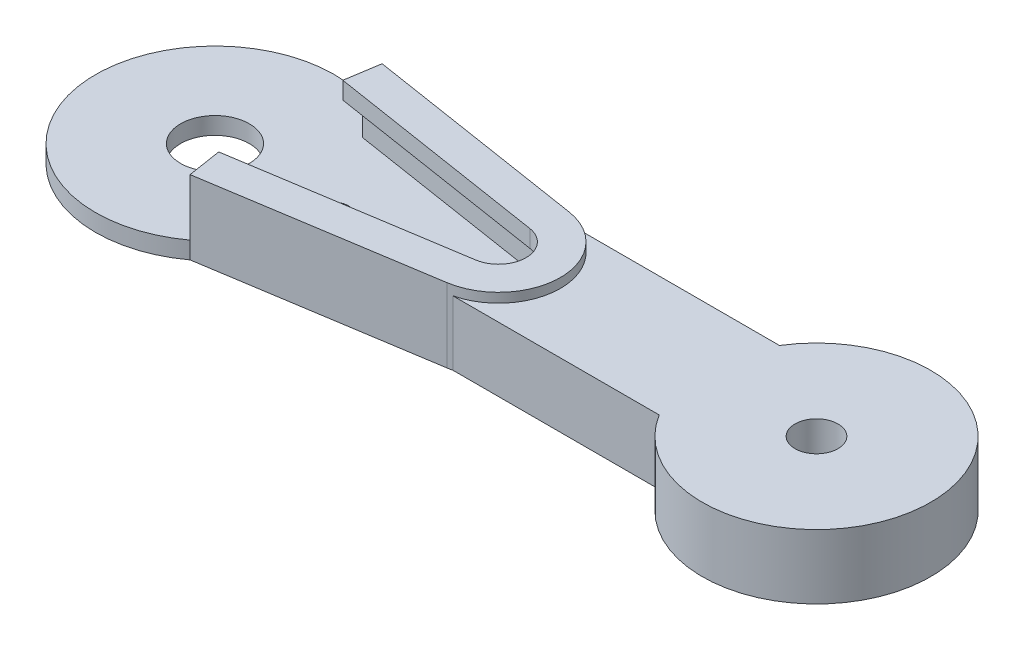
ISO-10303-21;
HEADER;
FILE_DESCRIPTION(('STEP AP214'),'2;1');
FILE_NAME('part.step','',(''),(''),'','','');
FILE_SCHEMA(('AUTOMOTIVE_DESIGN { 1 0 10303 214 1 1 1 1 }'));
ENDSEC;
DATA;
#1=APPLICATION_CONTEXT('core data for automotive mechanical design processes');
#2=APPLICATION_PROTOCOL_DEFINITION('international standard','automotive_design',2000,#1);
#3=PRODUCT_CONTEXT('',#1,'mechanical');
#4=PRODUCT('Part','Part','',(#3));
#5=PRODUCT_RELATED_PRODUCT_CATEGORY('part','',(#4));
#6=PRODUCT_DEFINITION_FORMATION('','',#4);
#7=PRODUCT_DEFINITION_CONTEXT('part definition',#1,'design');
#8=PRODUCT_DEFINITION('design','',#6,#7);
#9=PRODUCT_DEFINITION_SHAPE('','',#8);
#10=(LENGTH_UNIT() NAMED_UNIT(*) SI_UNIT(.MILLI.,.METRE.));
#11=(NAMED_UNIT(*) PLANE_ANGLE_UNIT() SI_UNIT($,.RADIAN.));
#12=(NAMED_UNIT(*) SI_UNIT($,.STERADIAN.) SOLID_ANGLE_UNIT());
#13=UNCERTAINTY_MEASURE_WITH_UNIT(LENGTH_MEASURE(1.E-05),#10,'distance_accuracy_value','');
#14=(GEOMETRIC_REPRESENTATION_CONTEXT(3) GLOBAL_UNCERTAINTY_ASSIGNED_CONTEXT((#13)) GLOBAL_UNIT_ASSIGNED_CONTEXT((#10,
#11,#12)) REPRESENTATION_CONTEXT('',''));
#15=CARTESIAN_POINT('',(0.,0.,0.));
#16=DIRECTION('',(0.,0.,1.));
#17=DIRECTION('',(1.,0.,0.));
#18=AXIS2_PLACEMENT_3D('',#15,#16,#17);
#19=CARTESIAN_POINT('',(0.,1.75,-3.5));
#20=DIRECTION('',(0.,0.,-1.));
#21=DIRECTION('',(-1.,0.,0.));
#22=AXIS2_PLACEMENT_3D('',#19,#20,#21);
#23=PLANE('',#22);
#24=DIRECTION('',(0.,-1.,0.));
#25=VECTOR('',#24,1.);
#26=CARTESIAN_POINT('',(17.3426149773176,1.75,-3.5));
#27=LINE('',#26,#25);
#28=CARTESIAN_POINT('',(17.3426149773176,1.6,-3.5));
#29=VERTEX_POINT('',#28);
#30=CARTESIAN_POINT('',(17.3426149773176,-2.15,-3.5));
#31=VERTEX_POINT('',#30);
#32=EDGE_CURVE('E189',#29,#31,#27,.T.);
#33=ORIENTED_EDGE('',*,*,#32,.F.);
#34=DIRECTION('',(-1.,0.,0.));
#35=VECTOR('',#34,1.);
#36=CARTESIAN_POINT('',(29.3455769525088,1.6,-3.5));
#37=LINE('',#36,#35);
#38=CARTESIAN_POINT('',(29.3455769525088,1.6,-3.5));
#39=VERTEX_POINT('',#38);
#40=EDGE_CURVE('E172',#39,#29,#37,.T.);
#41=ORIENTED_EDGE('',*,*,#40,.F.);
#42=DIRECTION('',(0.,-1.,0.));
#43=VECTOR('',#42,1.);
#44=CARTESIAN_POINT('',(29.3455769525088,7.85,-3.5));
#45=LINE('',#44,#43);
#46=CARTESIAN_POINT('',(29.3455769525088,-2.15,-3.5));
#47=VERTEX_POINT('',#46);
#48=EDGE_CURVE('E412',#39,#47,#45,.T.);
#49=ORIENTED_EDGE('',*,*,#48,.T.);
#50=DIRECTION('',(1.,0.,0.));
#51=VECTOR('',#50,1.);
#52=CARTESIAN_POINT('',(0.,-2.15,-3.5));
#53=LINE('',#52,#51);
#54=EDGE_CURVE('E197',#31,#47,#53,.T.);
#55=ORIENTED_EDGE('',*,*,#54,.F.);
#56=EDGE_LOOP('',(#33,#41,#49,#55));
#57=FACE_BOUND('',#56,.T.);
#58=ADVANCED_FACE('F47',(#57),#23,.T.);
#59=CARTESIAN_POINT('',(0.,1.75,3.5));
#60=DIRECTION('',(0.,0.,-1.));
#61=DIRECTION('',(-1.,0.,0.));
#62=AXIS2_PLACEMENT_3D('',#59,#60,#61);
#63=PLANE('',#62);
#64=DIRECTION('',(1.,0.,0.));
#65=VECTOR('',#64,1.);
#66=CARTESIAN_POINT('',(17.3426149773176,1.6,3.5));
#67=LINE('',#66,#65);
#68=CARTESIAN_POINT('',(17.3426149773176,1.6,3.5));
#69=VERTEX_POINT('',#68);
#70=CARTESIAN_POINT('',(29.3455769525088,1.6,3.5));
#71=VERTEX_POINT('',#70);
#72=EDGE_CURVE('E65',#69,#71,#67,.T.);
#73=ORIENTED_EDGE('',*,*,#72,.F.);
#74=DIRECTION('',(0.,-1.,0.));
#75=VECTOR('',#74,1.);
#76=CARTESIAN_POINT('',(17.3426149773176,1.75,3.5));
#77=LINE('',#76,#75);
#78=CARTESIAN_POINT('',(17.3426149773176,-2.15,3.5));
#79=VERTEX_POINT('',#78);
#80=EDGE_CURVE('E72',#69,#79,#77,.T.);
#81=ORIENTED_EDGE('',*,*,#80,.T.);
#82=DIRECTION('',(1.,0.,0.));
#83=VECTOR('',#82,1.);
#84=CARTESIAN_POINT('',(0.,-2.15,3.5));
#85=LINE('',#84,#83);
#86=CARTESIAN_POINT('',(29.3455769525088,-2.15,3.5));
#87=VERTEX_POINT('',#86);
#88=EDGE_CURVE('E393',#79,#87,#85,.T.);
#89=ORIENTED_EDGE('',*,*,#88,.T.);
#90=DIRECTION('',(0.,-1.,0.));
#91=VECTOR('',#90,1.);
#92=CARTESIAN_POINT('',(29.3455769525088,7.85,3.5));
#93=LINE('',#92,#91);
#94=EDGE_CURVE('E179',#71,#87,#93,.T.);
#95=ORIENTED_EDGE('',*,*,#94,.F.);
#96=EDGE_LOOP('',(#73,#81,#89,#95));
#97=FACE_BOUND('',#96,.T.);
#98=ADVANCED_FACE('F178',(#97),#63,.F.);
#99=CARTESIAN_POINT('',(35.,1.75,0.));
#100=DIRECTION('',(0.,-1.,0.));
#101=DIRECTION('',(0.,0.,-1.));
#102=AXIS2_PLACEMENT_3D('',#99,#100,#101);
#103=CYLINDRICAL_SURFACE('',#102,1.25);
#104=CARTESIAN_POINT('',(35.,-2.15,0.));
#105=DIRECTION('',(0.,-1.,0.));
#106=DIRECTION('',(0.,0.,-1.));
#107=AXIS2_PLACEMENT_3D('',#104,#105,#106);
#108=CIRCLE('',#107,1.25);
#109=CARTESIAN_POINT('',(35.,-2.15,-1.25));
#110=VERTEX_POINT('',#109);
#111=EDGE_CURVE('E190',#110,#110,#108,.T.);
#112=ORIENTED_EDGE('',*,*,#111,.T.);
#113=EDGE_LOOP('',(#112));
#114=FACE_BOUND('',#113,.T.);
#115=CARTESIAN_POINT('',(35.,1.6,0.));
#116=DIRECTION('',(0.,1.,0.));
#117=DIRECTION('',(0.,0.,1.));
#118=AXIS2_PLACEMENT_3D('',#115,#116,#117);
#119=CIRCLE('',#118,1.25);
#120=CARTESIAN_POINT('',(35.,1.6,1.25));
#121=VERTEX_POINT('',#120);
#122=EDGE_CURVE('E426',#121,#121,#119,.F.);
#123=ORIENTED_EDGE('',*,*,#122,.F.);
#124=EDGE_LOOP('',(#123));
#125=FACE_BOUND('',#124,.T.);
#126=ADVANCED_FACE('F437',(#114,#125),#103,.F.);
#127=CARTESIAN_POINT('',(35.,7.85,0.));
#128=DIRECTION('',(0.,-1.,0.));
#129=DIRECTION('',(0.,0.,-1.));
#130=AXIS2_PLACEMENT_3D('',#127,#128,#129);
#131=CYLINDRICAL_SURFACE('',#130,6.65000000000001);
#132=ORIENTED_EDGE('',*,*,#48,.F.);
#133=CARTESIAN_POINT('',(35.,1.6,0.));
#134=DIRECTION('',(0.,1.,0.));
#135=DIRECTION('',(0.,0.,1.));
#136=AXIS2_PLACEMENT_3D('',#133,#134,#135);
#137=CIRCLE('',#136,6.65);
#138=EDGE_CURVE('E181',#71,#39,#137,.T.);
#139=ORIENTED_EDGE('',*,*,#138,.F.);
#140=ORIENTED_EDGE('',*,*,#94,.T.);
#141=CARTESIAN_POINT('',(35.,-2.15,0.));
#142=DIRECTION('',(0.,-1.,0.));
#143=DIRECTION('',(0.,0.,-1.));
#144=AXIS2_PLACEMENT_3D('',#141,#142,#143);
#145=CIRCLE('',#144,6.65000000000001);
#146=EDGE_CURVE('E421',#47,#87,#145,.T.);
#147=ORIENTED_EDGE('',*,*,#146,.F.);
#148=EDGE_LOOP('',(#132,#139,#140,#147));
#149=FACE_BOUND('',#148,.T.);
#150=ADVANCED_FACE('F434',(#149),#131,.T.);
#151=CARTESIAN_POINT('',(7.,1.15,0.));
#152=DIRECTION('',(0.,-1.,0.));
#153=DIRECTION('',(0.,0.,-1.));
#154=AXIS2_PLACEMENT_3D('',#151,#152,#153);
#155=CYLINDRICAL_SURFACE('',#154,0.750000000000002);
#156=CARTESIAN_POINT('',(7.,-2.15,0.));
#157=DIRECTION('',(0.,-1.,0.));
#158=DIRECTION('',(0.,0.,-1.));
#159=AXIS2_PLACEMENT_3D('',#156,#157,#158);
#160=CIRCLE('',#159,0.749999999999999);
#161=CARTESIAN_POINT('',(7.,-2.15,-0.749999999999999));
#162=VERTEX_POINT('',#161);
#163=EDGE_CURVE('E261',#162,#162,#160,.T.);
#164=ORIENTED_EDGE('',*,*,#163,.T.);
#165=EDGE_LOOP('',(#164));
#166=FACE_BOUND('',#165,.T.);
#167=CARTESIAN_POINT('',(7.,-1.15,0.));
#168=DIRECTION('',(0.,1.,0.));
#169=DIRECTION('',(0.,0.,1.));
#170=AXIS2_PLACEMENT_3D('',#167,#168,#169);
#171=CIRCLE('',#170,0.750000000000002);
#172=CARTESIAN_POINT('',(7.,-1.15,0.750000000000065));
#173=VERTEX_POINT('',#172);
#174=EDGE_CURVE('E347',#173,#173,#171,.T.);
#175=ORIENTED_EDGE('',*,*,#174,.T.);
#176=EDGE_LOOP('',(#175));
#177=FACE_BOUND('',#176,.T.);
#178=ADVANCED_FACE('F436',(#166,#177),#155,.F.);
#179=CARTESIAN_POINT('',(16.,1.15,0.));
#180=DIRECTION('',(0.,-1.,0.));
#181=DIRECTION('',(0.,0.,-1.));
#182=AXIS2_PLACEMENT_3D('',#179,#180,#181);
#183=CYLINDRICAL_SURFACE('',#182,0.750000000000002);
#184=CARTESIAN_POINT('',(16.,-2.15,0.));
#185=DIRECTION('',(0.,-1.,0.));
#186=DIRECTION('',(0.,0.,-1.));
#187=AXIS2_PLACEMENT_3D('',#184,#185,#186);
#188=CIRCLE('',#187,0.749999999999998);
#189=CARTESIAN_POINT('',(16.,-2.15,-0.749999999999998));
#190=VERTEX_POINT('',#189);
#191=EDGE_CURVE('E358',#190,#190,#188,.T.);
#192=ORIENTED_EDGE('',*,*,#191,.T.);
#193=EDGE_LOOP('',(#192));
#194=FACE_BOUND('',#193,.T.);
#195=CARTESIAN_POINT('',(16.,-1.15,0.));
#196=DIRECTION('',(0.,1.,0.));
#197=DIRECTION('',(0.,0.,1.));
#198=AXIS2_PLACEMENT_3D('',#195,#196,#197);
#199=CIRCLE('',#198,0.750000000000002);
#200=CARTESIAN_POINT('',(16.,-1.15,0.750000000000002));
#201=VERTEX_POINT('',#200);
#202=EDGE_CURVE('E357',#201,#201,#199,.T.);
#203=ORIENTED_EDGE('',*,*,#202,.T.);
#204=EDGE_LOOP('',(#203));
#205=FACE_BOUND('',#204,.T.);
#206=ADVANCED_FACE('F444',(#194,#205),#183,.F.);
#207=CARTESIAN_POINT('',(13.,1.15,0.));
#208=DIRECTION('',(0.,-1.,0.));
#209=DIRECTION('',(0.,0.,-1.));
#210=AXIS2_PLACEMENT_3D('',#207,#208,#209);
#211=CYLINDRICAL_SURFACE('',#210,0.750000000000002);
#212=CARTESIAN_POINT('',(13.,-2.15,0.));
#213=DIRECTION('',(0.,-1.,0.));
#214=DIRECTION('',(0.,0.,-1.));
#215=AXIS2_PLACEMENT_3D('',#212,#213,#214);
#216=CIRCLE('',#215,0.749999999999998);
#217=CARTESIAN_POINT('',(13.,-2.15,-0.749999999999998));
#218=VERTEX_POINT('',#217);
#219=EDGE_CURVE('E353',#218,#218,#216,.T.);
#220=ORIENTED_EDGE('',*,*,#219,.T.);
#221=EDGE_LOOP('',(#220));
#222=FACE_BOUND('',#221,.T.);
#223=CARTESIAN_POINT('',(13.,-1.15,0.));
#224=DIRECTION('',(0.,1.,0.));
#225=DIRECTION('',(0.,0.,1.));
#226=AXIS2_PLACEMENT_3D('',#223,#224,#225);
#227=CIRCLE('',#226,0.750000000000002);
#228=CARTESIAN_POINT('',(13.,-1.15,0.750000000000023));
#229=VERTEX_POINT('',#228);
#230=EDGE_CURVE('E352',#229,#229,#227,.T.);
#231=ORIENTED_EDGE('',*,*,#230,.T.);
#232=EDGE_LOOP('',(#231));
#233=FACE_BOUND('',#232,.T.);
#234=ADVANCED_FACE('F481',(#222,#233),#211,.F.);
#235=CARTESIAN_POINT('',(10.,1.15,0.));
#236=DIRECTION('',(0.,-1.,0.));
#237=DIRECTION('',(0.,0.,-1.));
#238=AXIS2_PLACEMENT_3D('',#235,#236,#237);
#239=CYLINDRICAL_SURFACE('',#238,0.750000000000002);
#240=CARTESIAN_POINT('',(10.,-2.15,0.));
#241=DIRECTION('',(0.,-1.,0.));
#242=DIRECTION('',(0.,0.,-1.));
#243=AXIS2_PLACEMENT_3D('',#240,#241,#242);
#244=CIRCLE('',#243,0.75);
#245=CARTESIAN_POINT('',(10.,-2.15,-0.75));
#246=VERTEX_POINT('',#245);
#247=EDGE_CURVE('E348',#246,#246,#244,.T.);
#248=ORIENTED_EDGE('',*,*,#247,.T.);
#249=EDGE_LOOP('',(#248));
#250=FACE_BOUND('',#249,.T.);
#251=CARTESIAN_POINT('',(10.,-1.15,0.));
#252=DIRECTION('',(0.,1.,0.));
#253=DIRECTION('',(0.,0.,1.));
#254=AXIS2_PLACEMENT_3D('',#251,#252,#253);
#255=CIRCLE('',#254,0.750000000000002);
#256=CARTESIAN_POINT('',(10.,-1.15,0.750000000000044));
#257=VERTEX_POINT('',#256);
#258=EDGE_CURVE('E301',#257,#257,#255,.T.);
#259=ORIENTED_EDGE('',*,*,#258,.T.);
#260=EDGE_LOOP('',(#259));
#261=FACE_BOUND('',#260,.T.);
#262=ADVANCED_FACE('F374',(#250,#261),#239,.F.);
#263=CARTESIAN_POINT('',(0.,-2.15,0.));
#264=DIRECTION('',(0.,1.,0.));
#265=DIRECTION('',(0.,0.,1.));
#266=AXIS2_PLACEMENT_3D('',#263,#264,#265);
#267=CYLINDRICAL_SURFACE('',#266,2.);
#268=CARTESIAN_POINT('',(0.,-2.15,0.));
#269=DIRECTION('',(0.,-1.,0.));
#270=DIRECTION('',(0.,0.,-1.));
#271=AXIS2_PLACEMENT_3D('',#268,#269,#270);
#272=CIRCLE('',#271,2.);
#273=CARTESIAN_POINT('',(0.,-2.15,-2.));
#274=VERTEX_POINT('',#273);
#275=EDGE_CURVE('E297',#274,#274,#272,.T.);
#276=ORIENTED_EDGE('',*,*,#275,.T.);
#277=EDGE_LOOP('',(#276));
#278=FACE_BOUND('',#277,.T.);
#279=CARTESIAN_POINT('',(0.,-1.15,0.));
#280=DIRECTION('',(0.,1.,0.));
#281=DIRECTION('',(0.,0.,1.));
#282=AXIS2_PLACEMENT_3D('',#279,#280,#281);
#283=CIRCLE('',#282,2.);
#284=CARTESIAN_POINT('',(0.,-1.15,2.));
#285=VERTEX_POINT('',#284);
#286=EDGE_CURVE('E51',#285,#285,#283,.T.);
#287=ORIENTED_EDGE('',*,*,#286,.T.);
#288=EDGE_LOOP('',(#287));
#289=FACE_BOUND('',#288,.T.);
#290=ADVANCED_FACE('F488',(#278,#289),#267,.F.);
#291=CARTESIAN_POINT('',(17.0588844447433,-2.15,3.55635321325428));
#292=DIRECTION('',(-0.155245679095352,0.,-0.987875892570632));
#293=DIRECTION('',(-0.987875892570632,0.,0.155245679095352));
#294=AXIS2_PLACEMENT_3D('',#291,#292,#293);
#295=PLANE('',#294);
#296=DIRECTION('',(0.,1.,0.));
#297=VECTOR('',#296,1.);
#298=CARTESIAN_POINT('',(17.0588844447433,-2.15,3.55635321325428));
#299=LINE('',#298,#297);
#300=CARTESIAN_POINT('',(17.0588844447433,-2.15,3.55635321325428));
#301=VERTEX_POINT('',#300);
#302=CARTESIAN_POINT('',(17.0588844447433,2.15,3.55635321325427));
#303=VERTEX_POINT('',#302);
#304=EDGE_CURVE('E271',#301,#303,#299,.T.);
#305=ORIENTED_EDGE('',*,*,#304,.T.);
#306=DIRECTION('',(0.987875892570632,0.,-0.155245679095352));
#307=VECTOR('',#306,1.);
#308=CARTESIAN_POINT('',(0.956554589226585,2.15,6.08685036602117));
#309=LINE('',#308,#307);
#310=CARTESIAN_POINT('',(4.13939721360178,2.15,5.58666348182769));
#311=VERTEX_POINT('',#310);
#312=EDGE_CURVE('E227',#311,#303,#309,.T.);
#313=ORIENTED_EDGE('',*,*,#312,.F.);
#314=DIRECTION('',(0.,-1.,0.));
#315=VECTOR('',#314,1.);
#316=CARTESIAN_POINT('',(4.13939721360178,1.15,5.58666348182769));
#317=LINE('',#316,#315);
#318=CARTESIAN_POINT('',(4.13939721360178,-1.15,5.58666348182769));
#319=VERTEX_POINT('',#318);
#320=EDGE_CURVE('E270',#311,#319,#317,.T.);
#321=ORIENTED_EDGE('',*,*,#320,.T.);
#322=DIRECTION('',(0.,1.,0.));
#323=VECTOR('',#322,1.);
#324=CARTESIAN_POINT('',(4.13939721360177,-2.15,5.5866634818277));
#325=LINE('',#324,#323);
#326=CARTESIAN_POINT('',(4.13939721360177,-2.15,5.5866634818277));
#327=VERTEX_POINT('',#326);
#328=EDGE_CURVE('E274',#327,#319,#325,.T.);
#329=ORIENTED_EDGE('',*,*,#328,.F.);
#330=DIRECTION('',(-0.987875892570632,0.,0.155245679095352));
#331=VECTOR('',#330,1.);
#332=CARTESIAN_POINT('',(17.0588844447433,-2.15,3.55635321325428));
#333=LINE('',#332,#331);
#334=EDGE_CURVE('E281',#301,#327,#333,.T.);
#335=ORIENTED_EDGE('',*,*,#334,.F.);
#336=EDGE_LOOP('',(#305,#313,#321,#329,#335));
#337=FACE_BOUND('',#336,.T.);
#338=ADVANCED_FACE('F397',(#337),#295,.F.);
#339=CARTESIAN_POINT('',(16.5,-2.15,0.));
#340=DIRECTION('',(0.,1.,0.));
#341=DIRECTION('',(0.,0.,1.));
#342=AXIS2_PLACEMENT_3D('',#339,#340,#341);
#343=CYLINDRICAL_SURFACE('',#342,3.6);
#344=DIRECTION('',(0.,1.,0.));
#345=VECTOR('',#344,1.);
#346=CARTESIAN_POINT('',(17.0588844447433,-2.15,-3.55635321325428));
#347=LINE('',#346,#345);
#348=CARTESIAN_POINT('',(17.0588844447433,-2.15,-3.55635321325428));
#349=VERTEX_POINT('',#348);
#350=CARTESIAN_POINT('',(17.0588844447433,2.15,-3.55635321325427));
#351=VERTEX_POINT('',#350);
#352=EDGE_CURVE('E267',#349,#351,#347,.T.);
#353=ORIENTED_EDGE('',*,*,#352,.T.);
#354=CARTESIAN_POINT('',(16.5,2.15,0.));
#355=DIRECTION('',(0.,1.,0.));
#356=DIRECTION('',(0.,0.,1.));
#357=AXIS2_PLACEMENT_3D('',#354,#355,#356);
#358=CIRCLE('',#357,3.6);
#359=EDGE_CURVE('E200',#303,#351,#358,.T.);
#360=ORIENTED_EDGE('',*,*,#359,.F.);
#361=ORIENTED_EDGE('',*,*,#304,.F.);
#362=CARTESIAN_POINT('',(16.5,-2.15,0.));
#363=DIRECTION('',(0.,-1.,0.));
#364=DIRECTION('',(0.,0.,-1.));
#365=AXIS2_PLACEMENT_3D('',#362,#363,#364);
#366=CIRCLE('',#365,3.6);
#367=EDGE_CURVE('E187',#79,#301,#366,.T.);
#368=ORIENTED_EDGE('',*,*,#367,.F.);
#369=ORIENTED_EDGE('',*,*,#80,.F.);
#370=CARTESIAN_POINT('',(16.5,1.6,0.));
#371=DIRECTION('',(0.,-1.,0.));
#372=DIRECTION('',(0.,0.,1.));
#373=AXIS2_PLACEMENT_3D('',#370,#371,#372);
#374=CIRCLE('',#373,3.6);
#375=EDGE_CURVE('E168',#29,#69,#374,.T.);
#376=ORIENTED_EDGE('',*,*,#375,.F.);
#377=ORIENTED_EDGE('',*,*,#32,.T.);
#378=EDGE_CURVE('E285',#349,#31,#366,.T.);
#379=ORIENTED_EDGE('',*,*,#378,.F.);
#380=EDGE_LOOP('',(#353,#360,#361,#368,#369,#376,#377,#379));
#381=FACE_BOUND('',#380,.T.);
#382=ADVANCED_FACE('F185',(#381),#343,.T.);
#383=CARTESIAN_POINT('',(4.13939721360177,-2.15,-5.58666348182769));
#384=DIRECTION('',(-0.155245679095352,0.,0.987875892570632));
#385=DIRECTION('',(0.987875892570632,0.,0.155245679095352));
#386=AXIS2_PLACEMENT_3D('',#383,#384,#385);
#387=PLANE('',#386);
#388=DIRECTION('',(0.,1.,0.));
#389=VECTOR('',#388,1.);
#390=CARTESIAN_POINT('',(4.13939721360177,-2.15,-5.58666348182769));
#391=LINE('',#390,#389);
#392=CARTESIAN_POINT('',(4.13939721360177,-2.15,-5.58666348182769));
#393=VERTEX_POINT('',#392);
#394=CARTESIAN_POINT('',(4.13939721360177,-1.15,-5.58666348182769));
#395=VERTEX_POINT('',#394);
#396=EDGE_CURVE('E262',#393,#395,#391,.T.);
#397=ORIENTED_EDGE('',*,*,#396,.T.);
#398=DIRECTION('',(0.,-1.,0.));
#399=VECTOR('',#398,1.);
#400=CARTESIAN_POINT('',(4.13939721360177,1.15,-5.58666348182769));
#401=LINE('',#400,#399);
#402=CARTESIAN_POINT('',(4.13939721360177,2.15,-5.5866634818277));
#403=VERTEX_POINT('',#402);
#404=EDGE_CURVE('E284',#403,#395,#401,.T.);
#405=ORIENTED_EDGE('',*,*,#404,.F.);
#406=DIRECTION('',(-0.987875892570632,0.,-0.155245679095352));
#407=VECTOR('',#406,1.);
#408=CARTESIAN_POINT('',(0.956554589226585,2.15,-6.08685036602117));
#409=LINE('',#408,#407);
#410=EDGE_CURVE('E203',#351,#403,#409,.T.);
#411=ORIENTED_EDGE('',*,*,#410,.F.);
#412=ORIENTED_EDGE('',*,*,#352,.F.);
#413=DIRECTION('',(0.987875892570632,0.,0.155245679095352));
#414=VECTOR('',#413,1.);
#415=CARTESIAN_POINT('',(4.13939721360177,-2.15,-5.58666348182769));
#416=LINE('',#415,#414);
#417=EDGE_CURVE('E289',#393,#349,#416,.T.);
#418=ORIENTED_EDGE('',*,*,#417,.F.);
#419=EDGE_LOOP('',(#397,#405,#411,#412,#418));
#420=FACE_BOUND('',#419,.T.);
#421=ADVANCED_FACE('F408',(#420),#387,.F.);
#422=CARTESIAN_POINT('',(0.,-2.15,0.));
#423=DIRECTION('',(0.,1.,0.));
#424=DIRECTION('',(0.,0.,1.));
#425=AXIS2_PLACEMENT_3D('',#422,#423,#424);
#426=CYLINDRICAL_SURFACE('',#425,6.95308695121536);
#427=CARTESIAN_POINT('',(0.,-1.15,0.));
#428=DIRECTION('',(0.,-1.,0.));
#429=DIRECTION('',(0.,0.,-1.));
#430=AXIS2_PLACEMENT_3D('',#427,#428,#429);
#431=CIRCLE('',#430,6.95308695121536);
#432=EDGE_CURVE('E266',#319,#395,#431,.T.);
#433=ORIENTED_EDGE('',*,*,#432,.T.);
#434=ORIENTED_EDGE('',*,*,#396,.F.);
#435=CARTESIAN_POINT('',(0.,-2.15,0.));
#436=DIRECTION('',(0.,-1.,0.));
#437=DIRECTION('',(0.,0.,-1.));
#438=AXIS2_PLACEMENT_3D('',#435,#436,#437);
#439=CIRCLE('',#438,6.95308695121536);
#440=EDGE_CURVE('E292',#327,#393,#439,.T.);
#441=ORIENTED_EDGE('',*,*,#440,.F.);
#442=ORIENTED_EDGE('',*,*,#328,.T.);
#443=EDGE_LOOP('',(#433,#434,#441,#442));
#444=FACE_BOUND('',#443,.T.);
#445=ADVANCED_FACE('F380',(#444),#426,.T.);
#446=CARTESIAN_POINT('',(0.,-1.15,0.));
#447=DIRECTION('',(0.,-1.,0.));
#448=DIRECTION('',(0.,0.,-1.));
#449=AXIS2_PLACEMENT_3D('',#446,#447,#448);
#450=PLANE('',#449);
#451=DIRECTION('',(-0.987875892570632,0.,-0.155245679095352));
#452=VECTOR('',#451,1.);
#453=CARTESIAN_POINT('',(0.801308910131233,-1.15,-5.09897447345054));
#454=LINE('',#453,#452);
#455=CARTESIAN_POINT('',(16.9036387656479,-1.15,-2.56847732068364));
#456=VERTEX_POINT('',#455);
#457=CARTESIAN_POINT('',(3.98415153450642,-1.15,-4.59878758925706));
#458=VERTEX_POINT('',#457);
#459=EDGE_CURVE('E278',#456,#458,#454,.T.);
#460=ORIENTED_EDGE('',*,*,#459,.T.);
#461=DIRECTION('',(0.15524567909535,0.,-0.987875892570632));
#462=VECTOR('',#461,1.);
#463=CARTESIAN_POINT('',(3.1828426243752,-1.15,0.500186884193477));
#464=LINE('',#463,#462);
#465=EDGE_CURVE('E323',#458,#395,#464,.T.);
#466=ORIENTED_EDGE('',*,*,#465,.T.);
#467=ORIENTED_EDGE('',*,*,#432,.F.);
#468=DIRECTION('',(-0.155245679095351,0.,-0.987875892570632));
#469=VECTOR('',#468,1.);
#470=CARTESIAN_POINT('',(3.18284262437519,-1.15,-0.500186884193479));
#471=LINE('',#470,#469);
#472=CARTESIAN_POINT('',(3.98415153450643,-1.15,4.59878758925706));
#473=VERTEX_POINT('',#472);
#474=EDGE_CURVE('E296',#319,#473,#471,.T.);
#475=ORIENTED_EDGE('',*,*,#474,.T.);
#476=DIRECTION('',(-0.987875892570632,0.,0.155245679095352));
#477=VECTOR('',#476,1.);
#478=CARTESIAN_POINT('',(0.801308910131233,-1.15,5.09897447345054));
#479=LINE('',#478,#477);
#480=CARTESIAN_POINT('',(16.9036387656479,-1.15,2.56847732068364));
#481=VERTEX_POINT('',#480);
#482=EDGE_CURVE('E311',#481,#473,#479,.T.);
#483=ORIENTED_EDGE('',*,*,#482,.F.);
#484=CARTESIAN_POINT('',(16.5,-1.15,0.));
#485=DIRECTION('',(0.,-1.,0.));
#486=DIRECTION('',(0.,0.,-1.));
#487=AXIS2_PLACEMENT_3D('',#484,#485,#486);
#488=CIRCLE('',#487,2.6);
#489=EDGE_CURVE('E315',#456,#481,#488,.T.);
#490=ORIENTED_EDGE('',*,*,#489,.F.);
#491=EDGE_LOOP('',(#460,#466,#467,#475,#483,#490));
#492=FACE_BOUND('',#491,.T.);
#493=ORIENTED_EDGE('',*,*,#174,.F.);
#494=EDGE_LOOP('',(#493));
#495=FACE_BOUND('',#494,.T.);
#496=ORIENTED_EDGE('',*,*,#202,.F.);
#497=EDGE_LOOP('',(#496));
#498=FACE_BOUND('',#497,.T.);
#499=ORIENTED_EDGE('',*,*,#230,.F.);
#500=EDGE_LOOP('',(#499));
#501=FACE_BOUND('',#500,.T.);
#502=ORIENTED_EDGE('',*,*,#258,.F.);
#503=EDGE_LOOP('',(#502));
#504=FACE_BOUND('',#503,.T.);
#505=ORIENTED_EDGE('',*,*,#286,.F.);
#506=EDGE_LOOP('',(#505));
#507=FACE_BOUND('',#506,.T.);
#508=ADVANCED_FACE('F376',(#492,#495,#498,#501,#504,#507),#450,.F.);
#509=CARTESIAN_POINT('',(0.,-2.15,0.));
#510=DIRECTION('',(0.,-1.,0.));
#511=DIRECTION('',(0.,0.,-1.));
#512=AXIS2_PLACEMENT_3D('',#509,#510,#511);
#513=PLANE('',#512);
#514=ORIENTED_EDGE('',*,*,#146,.T.);
#515=ORIENTED_EDGE('',*,*,#88,.F.);
#516=ORIENTED_EDGE('',*,*,#367,.T.);
#517=ORIENTED_EDGE('',*,*,#334,.T.);
#518=ORIENTED_EDGE('',*,*,#440,.T.);
#519=ORIENTED_EDGE('',*,*,#417,.T.);
#520=ORIENTED_EDGE('',*,*,#378,.T.);
#521=ORIENTED_EDGE('',*,*,#54,.T.);
#522=EDGE_LOOP('',(#514,#515,#516,#517,#518,#519,#520,#521));
#523=FACE_BOUND('',#522,.T.);
#524=ORIENTED_EDGE('',*,*,#191,.F.);
#525=EDGE_LOOP('',(#524));
#526=FACE_BOUND('',#525,.T.);
#527=ORIENTED_EDGE('',*,*,#219,.F.);
#528=EDGE_LOOP('',(#527));
#529=FACE_BOUND('',#528,.T.);
#530=ORIENTED_EDGE('',*,*,#247,.F.);
#531=EDGE_LOOP('',(#530));
#532=FACE_BOUND('',#531,.T.);
#533=ORIENTED_EDGE('',*,*,#163,.F.);
#534=EDGE_LOOP('',(#533));
#535=FACE_BOUND('',#534,.T.);
#536=ORIENTED_EDGE('',*,*,#275,.F.);
#537=EDGE_LOOP('',(#536));
#538=FACE_BOUND('',#537,.T.);
#539=ORIENTED_EDGE('',*,*,#111,.F.);
#540=EDGE_LOOP('',(#539));
#541=FACE_BOUND('',#540,.T.);
#542=ADVANCED_FACE('F379',(#523,#526,#529,#532,#535,#538,#541),#513,.T.);
#543=CARTESIAN_POINT('',(3.1828426243752,1.15,0.500186884193477));
#544=DIRECTION('',(-0.987875892570632,0.,-0.15524567909535));
#545=DIRECTION('',(-0.15524567909535,0.,0.987875892570632));
#546=AXIS2_PLACEMENT_3D('',#543,#544,#545);
#547=PLANE('',#546);
#548=ORIENTED_EDGE('',*,*,#465,.F.);
#549=DIRECTION('',(0.,-1.,0.));
#550=VECTOR('',#549,1.);
#551=CARTESIAN_POINT('',(3.98415153450642,1.15,-4.59878758925706));
#552=LINE('',#551,#550);
#553=CARTESIAN_POINT('',(3.98415153450642,1.15,-4.59878758925706));
#554=VERTEX_POINT('',#553);
#555=EDGE_CURVE('E316',#554,#458,#552,.T.);
#556=ORIENTED_EDGE('',*,*,#555,.F.);
#557=DIRECTION('',(-0.15524567909535,0.,0.987875892570632));
#558=VECTOR('',#557,1.);
#559=CARTESIAN_POINT('',(3.1828426243752,1.15,0.500186884193477));
#560=LINE('',#559,#558);
#561=CARTESIAN_POINT('',(3.82890585541107,1.15,-3.61091169668643));
#562=VERTEX_POINT('',#561);
#563=EDGE_CURVE('E194',#554,#562,#560,.T.);
#564=ORIENTED_EDGE('',*,*,#563,.T.);
#565=DIRECTION('',(0.,-1.,0.));
#566=VECTOR('',#565,1.);
#567=CARTESIAN_POINT('',(3.82890585541107,2.15,-3.61091169668643));
#568=LINE('',#567,#566);
#569=CARTESIAN_POINT('',(3.82890585541107,2.15,-3.61091169668643));
#570=VERTEX_POINT('',#569);
#571=EDGE_CURVE('E257',#570,#562,#568,.T.);
#572=ORIENTED_EDGE('',*,*,#571,.F.);
#573=DIRECTION('',(-0.15524567909535,0.,0.987875892570632));
#574=VECTOR('',#573,1.);
#575=CARTESIAN_POINT('',(3.1828426243752,2.15,0.500186884193477));
#576=LINE('',#575,#574);
#577=EDGE_CURVE('E208',#403,#570,#576,.T.);
#578=ORIENTED_EDGE('',*,*,#577,.F.);
#579=ORIENTED_EDGE('',*,*,#404,.T.);
#580=EDGE_LOOP('',(#548,#556,#564,#572,#578,#579));
#581=FACE_BOUND('',#580,.T.);
#582=ADVANCED_FACE('F49',(#581),#547,.T.);
#583=CARTESIAN_POINT('',(0.801308910131233,1.15,-5.09897447345054));
#584=DIRECTION('',(-0.155245679095352,0.,0.987875892570632));
#585=DIRECTION('',(0.987875892570632,0.,0.155245679095352));
#586=AXIS2_PLACEMENT_3D('',#583,#584,#585);
#587=PLANE('',#586);
#588=ORIENTED_EDGE('',*,*,#459,.F.);
#589=DIRECTION('',(0.,-1.,0.));
#590=VECTOR('',#589,1.);
#591=CARTESIAN_POINT('',(16.9036387656479,1.15,-2.56847732068364));
#592=LINE('',#591,#590);
#593=CARTESIAN_POINT('',(16.9036387656479,1.15,-2.56847732068364));
#594=VERTEX_POINT('',#593);
#595=EDGE_CURVE('E312',#594,#456,#592,.T.);
#596=ORIENTED_EDGE('',*,*,#595,.F.);
#597=DIRECTION('',(-0.987875892570632,0.,-0.155245679095352));
#598=VECTOR('',#597,1.);
#599=CARTESIAN_POINT('',(0.801308910131233,1.15,-5.09897447345054));
#600=LINE('',#599,#598);
#601=EDGE_CURVE('E319',#594,#554,#600,.T.);
#602=ORIENTED_EDGE('',*,*,#601,.T.);
#603=ORIENTED_EDGE('',*,*,#555,.T.);
#604=EDGE_LOOP('',(#588,#596,#602,#603));
#605=FACE_BOUND('',#604,.T.);
#606=ADVANCED_FACE('F510',(#605),#587,.T.);
#607=CARTESIAN_POINT('',(16.5,1.15,0.));
#608=DIRECTION('',(0.,-1.,0.));
#609=DIRECTION('',(0.,0.,-1.));
#610=AXIS2_PLACEMENT_3D('',#607,#608,#609);
#611=CYLINDRICAL_SURFACE('',#610,2.6);
#612=ORIENTED_EDGE('',*,*,#489,.T.);
#613=DIRECTION('',(0.,-1.,0.));
#614=VECTOR('',#613,1.);
#615=CARTESIAN_POINT('',(16.9036387656479,1.15,2.56847732068364));
#616=LINE('',#615,#614);
#617=CARTESIAN_POINT('',(16.9036387656479,1.15,2.56847732068364));
#618=VERTEX_POINT('',#617);
#619=EDGE_CURVE('E307',#618,#481,#616,.T.);
#620=ORIENTED_EDGE('',*,*,#619,.F.);
#621=CARTESIAN_POINT('',(16.5,1.15,0.));
#622=DIRECTION('',(0.,-1.,0.));
#623=DIRECTION('',(0.,0.,-1.));
#624=AXIS2_PLACEMENT_3D('',#621,#622,#623);
#625=CIRCLE('',#624,2.6);
#626=EDGE_CURVE('E57',#594,#618,#625,.T.);
#627=ORIENTED_EDGE('',*,*,#626,.F.);
#628=ORIENTED_EDGE('',*,*,#595,.T.);
#629=EDGE_LOOP('',(#612,#620,#627,#628));
#630=FACE_BOUND('',#629,.T.);
#631=ADVANCED_FACE('F507',(#630),#611,.F.);
#632=CARTESIAN_POINT('',(0.801308910131233,1.15,5.09897447345054));
#633=DIRECTION('',(0.155245679095352,0.,0.987875892570632));
#634=DIRECTION('',(0.987875892570632,0.,-0.155245679095352));
#635=AXIS2_PLACEMENT_3D('',#632,#633,#634);
#636=PLANE('',#635);
#637=ORIENTED_EDGE('',*,*,#482,.T.);
#638=DIRECTION('',(0.,-1.,0.));
#639=VECTOR('',#638,1.);
#640=CARTESIAN_POINT('',(3.98415153450643,1.15,4.59878758925706));
#641=LINE('',#640,#639);
#642=CARTESIAN_POINT('',(3.98415153450643,1.15,4.59878758925706));
#643=VERTEX_POINT('',#642);
#644=EDGE_CURVE('E304',#643,#473,#641,.T.);
#645=ORIENTED_EDGE('',*,*,#644,.F.);
#646=DIRECTION('',(-0.987875892570632,0.,0.155245679095352));
#647=VECTOR('',#646,1.);
#648=CARTESIAN_POINT('',(0.801308910131233,1.15,5.09897447345054));
#649=LINE('',#648,#647);
#650=EDGE_CURVE('E11',#618,#643,#649,.T.);
#651=ORIENTED_EDGE('',*,*,#650,.F.);
#652=ORIENTED_EDGE('',*,*,#619,.T.);
#653=EDGE_LOOP('',(#637,#645,#651,#652));
#654=FACE_BOUND('',#653,.T.);
#655=ADVANCED_FACE('F503',(#654),#636,.F.);
#656=CARTESIAN_POINT('',(3.18284262437519,1.15,-0.500186884193479));
#657=DIRECTION('',(-0.987875892570632,0.,0.155245679095351));
#658=DIRECTION('',(0.155245679095351,0.,0.987875892570632));
#659=AXIS2_PLACEMENT_3D('',#656,#657,#658);
#660=PLANE('',#659);
#661=ORIENTED_EDGE('',*,*,#474,.F.);
#662=ORIENTED_EDGE('',*,*,#320,.F.);
#663=DIRECTION('',(0.155245679095351,0.,0.987875892570632));
#664=VECTOR('',#663,1.);
#665=CARTESIAN_POINT('',(3.18284262437519,2.15,-0.500186884193479));
#666=LINE('',#665,#664);
#667=CARTESIAN_POINT('',(3.82890585541107,2.15,3.61091169668643));
#668=VERTEX_POINT('',#667);
#669=EDGE_CURVE('E223',#668,#311,#666,.T.);
#670=ORIENTED_EDGE('',*,*,#669,.F.);
#671=DIRECTION('',(0.,-1.,0.));
#672=VECTOR('',#671,1.);
#673=CARTESIAN_POINT('',(3.82890585541107,2.15,3.61091169668643));
#674=LINE('',#673,#672);
#675=CARTESIAN_POINT('',(3.82890585541107,1.15,3.61091169668643));
#676=VERTEX_POINT('',#675);
#677=EDGE_CURVE('E231',#668,#676,#674,.T.);
#678=ORIENTED_EDGE('',*,*,#677,.T.);
#679=DIRECTION('',(0.155245679095351,0.,0.987875892570632));
#680=VECTOR('',#679,1.);
#681=CARTESIAN_POINT('',(3.18284262437519,1.15,-0.500186884193479));
#682=LINE('',#681,#680);
#683=EDGE_CURVE('E204',#676,#643,#682,.T.);
#684=ORIENTED_EDGE('',*,*,#683,.T.);
#685=ORIENTED_EDGE('',*,*,#644,.T.);
#686=EDGE_LOOP('',(#661,#662,#670,#678,#684,#685));
#687=FACE_BOUND('',#686,.T.);
#688=ADVANCED_FACE('F476',(#687),#660,.T.);
#689=CARTESIAN_POINT('',(0.646063231035882,2.15,-4.11109858087991));
#690=DIRECTION('',(-0.155245679095352,0.,0.987875892570632));
#691=DIRECTION('',(0.987875892570632,0.,0.155245679095352));
#692=AXIS2_PLACEMENT_3D('',#689,#690,#691);
#693=PLANE('',#692);
#694=DIRECTION('',(-0.987875892570632,0.,-0.155245679095352));
#695=VECTOR('',#694,1.);
#696=CARTESIAN_POINT('',(0.646063231035882,1.15,-4.11109858087991));
#697=LINE('',#696,#695);
#698=CARTESIAN_POINT('',(16.7483930865526,1.15,-1.58060142811301));
#699=VERTEX_POINT('',#698);
#700=EDGE_CURVE('E234',#699,#562,#697,.T.);
#701=ORIENTED_EDGE('',*,*,#700,.F.);
#702=DIRECTION('',(0.,-1.,0.));
#703=VECTOR('',#702,1.);
#704=CARTESIAN_POINT('',(16.7483930865526,2.15,-1.58060142811301));
#705=LINE('',#704,#703);
#706=CARTESIAN_POINT('',(16.7483930865526,2.15,-1.58060142811301));
#707=VERTEX_POINT('',#706);
#708=EDGE_CURVE('E254',#707,#699,#705,.T.);
#709=ORIENTED_EDGE('',*,*,#708,.F.);
#710=DIRECTION('',(-0.987875892570632,0.,-0.155245679095352));
#711=VECTOR('',#710,1.);
#712=CARTESIAN_POINT('',(0.646063231035882,2.15,-4.11109858087991));
#713=LINE('',#712,#711);
#714=EDGE_CURVE('E211',#707,#570,#713,.T.);
#715=ORIENTED_EDGE('',*,*,#714,.T.);
#716=ORIENTED_EDGE('',*,*,#571,.T.);
#717=EDGE_LOOP('',(#701,#709,#715,#716));
#718=FACE_BOUND('',#717,.T.);
#719=ADVANCED_FACE('F473',(#718),#693,.T.);
#720=CARTESIAN_POINT('',(16.5,2.15,0.));
#721=DIRECTION('',(0.,-1.,0.));
#722=DIRECTION('',(0.,0.,-1.));
#723=AXIS2_PLACEMENT_3D('',#720,#721,#722);
#724=CYLINDRICAL_SURFACE('',#723,1.6);
#725=CARTESIAN_POINT('',(16.5,1.15,0.));
#726=DIRECTION('',(0.,1.,0.));
#727=DIRECTION('',(0.,0.,1.));
#728=AXIS2_PLACEMENT_3D('',#725,#726,#727);
#729=CIRCLE('',#728,1.6);
#730=CARTESIAN_POINT('',(16.7483930865526,1.15,1.58060142811301));
#731=VERTEX_POINT('',#730);
#732=EDGE_CURVE('E238',#731,#699,#729,.T.);
#733=ORIENTED_EDGE('',*,*,#732,.F.);
#734=DIRECTION('',(0.,-1.,0.));
#735=VECTOR('',#734,1.);
#736=CARTESIAN_POINT('',(16.7483930865526,2.15,1.58060142811301));
#737=LINE('',#736,#735);
#738=CARTESIAN_POINT('',(16.7483930865526,2.15,1.58060142811301));
#739=VERTEX_POINT('',#738);
#740=EDGE_CURVE('E251',#739,#731,#737,.T.);
#741=ORIENTED_EDGE('',*,*,#740,.F.);
#742=CARTESIAN_POINT('',(16.5,2.15,0.));
#743=DIRECTION('',(0.,1.,0.));
#744=DIRECTION('',(0.,0.,1.));
#745=AXIS2_PLACEMENT_3D('',#742,#743,#744);
#746=CIRCLE('',#745,1.6);
#747=EDGE_CURVE('E215',#739,#707,#746,.T.);
#748=ORIENTED_EDGE('',*,*,#747,.T.);
#749=ORIENTED_EDGE('',*,*,#708,.T.);
#750=EDGE_LOOP('',(#733,#741,#748,#749));
#751=FACE_BOUND('',#750,.T.);
#752=ADVANCED_FACE('F469',(#751),#724,.F.);
#753=CARTESIAN_POINT('',(0.646063231035882,2.15,4.11109858087991));
#754=DIRECTION('',(-0.155245679095352,0.,-0.987875892570632));
#755=DIRECTION('',(-0.987875892570632,0.,0.155245679095352));
#756=AXIS2_PLACEMENT_3D('',#753,#754,#755);
#757=PLANE('',#756);
#758=DIRECTION('',(0.987875892570632,0.,-0.155245679095352));
#759=VECTOR('',#758,1.);
#760=CARTESIAN_POINT('',(0.646063231035882,1.15,4.11109858087991));
#761=LINE('',#760,#759);
#762=EDGE_CURVE('E242',#676,#731,#761,.T.);
#763=ORIENTED_EDGE('',*,*,#762,.F.);
#764=ORIENTED_EDGE('',*,*,#677,.F.);
#765=DIRECTION('',(0.987875892570632,0.,-0.155245679095352));
#766=VECTOR('',#765,1.);
#767=CARTESIAN_POINT('',(0.646063231035882,2.15,4.11109858087991));
#768=LINE('',#767,#766);
#769=EDGE_CURVE('E219',#668,#739,#768,.T.);
#770=ORIENTED_EDGE('',*,*,#769,.T.);
#771=ORIENTED_EDGE('',*,*,#740,.T.);
#772=EDGE_LOOP('',(#763,#764,#770,#771));
#773=FACE_BOUND('',#772,.T.);
#774=ADVANCED_FACE('F462',(#773),#757,.T.);
#775=CARTESIAN_POINT('',(0.,2.15,0.));
#776=DIRECTION('',(0.,1.,0.));
#777=DIRECTION('',(0.,0.,1.));
#778=AXIS2_PLACEMENT_3D('',#775,#776,#777);
#779=PLANE('',#778);
#780=ORIENTED_EDGE('',*,*,#359,.T.);
#781=ORIENTED_EDGE('',*,*,#410,.T.);
#782=ORIENTED_EDGE('',*,*,#577,.T.);
#783=ORIENTED_EDGE('',*,*,#714,.F.);
#784=ORIENTED_EDGE('',*,*,#747,.F.);
#785=ORIENTED_EDGE('',*,*,#769,.F.);
#786=ORIENTED_EDGE('',*,*,#669,.T.);
#787=ORIENTED_EDGE('',*,*,#312,.T.);
#788=EDGE_LOOP('',(#780,#781,#782,#783,#784,#785,#786,#787));
#789=FACE_BOUND('',#788,.T.);
#790=ADVANCED_FACE('F458',(#789),#779,.T.);
#791=CARTESIAN_POINT('',(0.,1.15,0.));
#792=DIRECTION('',(0.,1.,0.));
#793=DIRECTION('',(0.,0.,1.));
#794=AXIS2_PLACEMENT_3D('',#791,#792,#793);
#795=PLANE('',#794);
#796=ORIENTED_EDGE('',*,*,#601,.F.);
#797=ORIENTED_EDGE('',*,*,#626,.T.);
#798=ORIENTED_EDGE('',*,*,#650,.T.);
#799=ORIENTED_EDGE('',*,*,#683,.F.);
#800=ORIENTED_EDGE('',*,*,#762,.T.);
#801=ORIENTED_EDGE('',*,*,#732,.T.);
#802=ORIENTED_EDGE('',*,*,#700,.T.);
#803=ORIENTED_EDGE('',*,*,#563,.F.);
#804=EDGE_LOOP('',(#796,#797,#798,#799,#800,#801,#802,#803));
#805=FACE_BOUND('',#804,.T.);
#806=ADVANCED_FACE('F461',(#805),#795,.F.);
#807=CARTESIAN_POINT('',(16.5,1.6,0.));
#808=DIRECTION('',(0.,1.,0.));
#809=DIRECTION('',(0.,0.,1.));
#810=AXIS2_PLACEMENT_3D('',#807,#808,#809);
#811=PLANE('',#810);
#812=ORIENTED_EDGE('',*,*,#375,.T.);
#813=ORIENTED_EDGE('',*,*,#72,.T.);
#814=ORIENTED_EDGE('',*,*,#138,.T.);
#815=ORIENTED_EDGE('',*,*,#40,.T.);
#816=EDGE_LOOP('',(#812,#813,#814,#815));
#817=FACE_BOUND('',#816,.T.);
#818=ORIENTED_EDGE('',*,*,#122,.T.);
#819=EDGE_LOOP('',(#818));
#820=FACE_BOUND('',#819,.T.);
#821=ADVANCED_FACE('F169',(#817,#820),#811,.T.);
#822=CLOSED_SHELL('',(#58,#98,#126,#150,#178,#206,#234,#262,#290,#338,#382,#421,#445,#508,#542,
#582,#606,#631,#655,#688,#719,#752,#774,#790,#806,#821));
#823=MANIFOLD_SOLID_BREP('B2',#822);
#824=ADVANCED_BREP_SHAPE_REPRESENTATION('',(#18,#823),#14);
#825=SHAPE_DEFINITION_REPRESENTATION(#9,#824);
ENDSEC;
END-ISO-10303-21;
